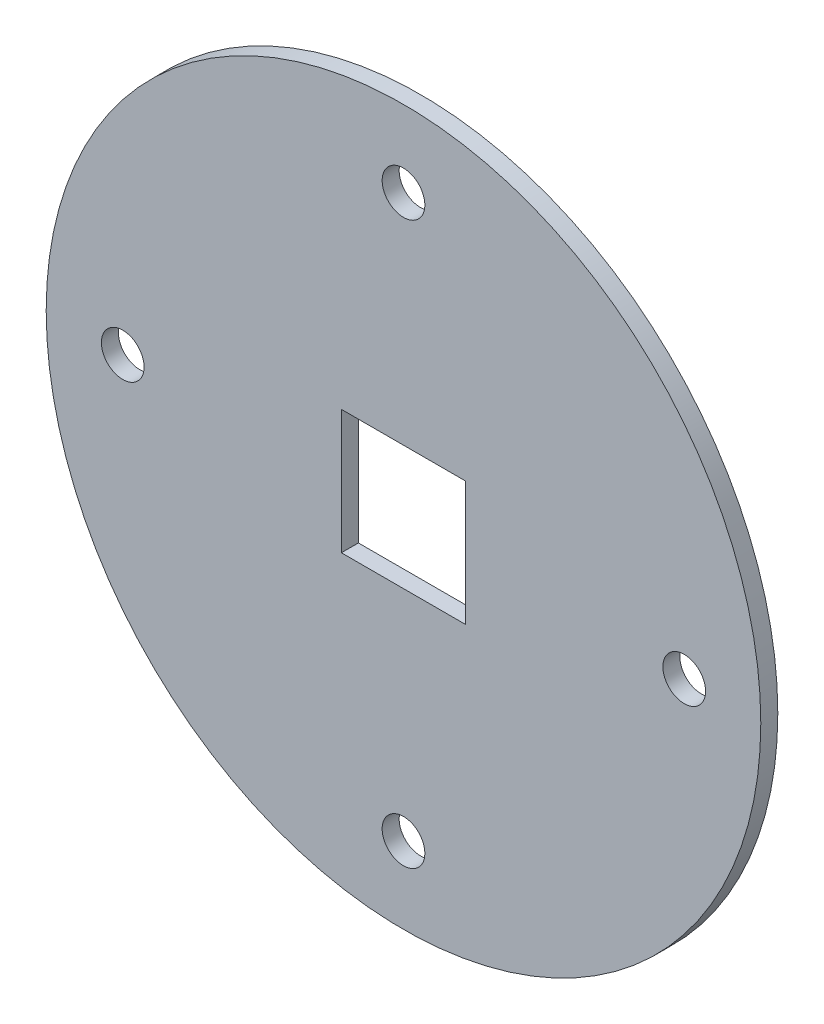
ISO-10303-21;
HEADER;
FILE_DESCRIPTION(('STEP AP214'),'2;1');
FILE_NAME('part.step','',(''),(''),'','','');
FILE_SCHEMA(('AUTOMOTIVE_DESIGN { 1 0 10303 214 1 1 1 1 }'));
ENDSEC;
DATA;
#1=APPLICATION_CONTEXT('core data for automotive mechanical design processes');
#2=APPLICATION_PROTOCOL_DEFINITION('international standard','automotive_design',2000,#1);
#3=PRODUCT_CONTEXT('',#1,'mechanical');
#4=PRODUCT('Part','Part','',(#3));
#5=PRODUCT_RELATED_PRODUCT_CATEGORY('part','',(#4));
#6=PRODUCT_DEFINITION_FORMATION('','',#4);
#7=PRODUCT_DEFINITION_CONTEXT('part definition',#1,'design');
#8=PRODUCT_DEFINITION('design','',#6,#7);
#9=PRODUCT_DEFINITION_SHAPE('','',#8);
#10=(LENGTH_UNIT() NAMED_UNIT(*) SI_UNIT(.MILLI.,.METRE.));
#11=(NAMED_UNIT(*) PLANE_ANGLE_UNIT() SI_UNIT($,.RADIAN.));
#12=(NAMED_UNIT(*) SI_UNIT($,.STERADIAN.) SOLID_ANGLE_UNIT());
#13=UNCERTAINTY_MEASURE_WITH_UNIT(LENGTH_MEASURE(1.E-05),#10,'distance_accuracy_value','');
#14=(GEOMETRIC_REPRESENTATION_CONTEXT(3) GLOBAL_UNCERTAINTY_ASSIGNED_CONTEXT((#13)) GLOBAL_UNIT_ASSIGNED_CONTEXT((#10,
#11,#12)) REPRESENTATION_CONTEXT('',''));
#15=CARTESIAN_POINT('',(0.,0.,0.));
#16=DIRECTION('',(0.,0.,1.));
#17=DIRECTION('',(1.,0.,0.));
#18=AXIS2_PLACEMENT_3D('',#15,#16,#17);
#19=CARTESIAN_POINT('',(0.,0.,10.));
#20=DIRECTION('',(0.,0.,1.));
#21=DIRECTION('',(1.,0.,0.));
#22=AXIS2_PLACEMENT_3D('',#19,#20,#21);
#23=PLANE('',#22);
#24=CARTESIAN_POINT('',(0.,-165.,10.));
#25=DIRECTION('',(0.,0.,1.));
#26=DIRECTION('',(1.,0.,0.));
#27=AXIS2_PLACEMENT_3D('',#24,#25,#26);
#28=CIRCLE('',#27,12.55);
#29=CARTESIAN_POINT('',(12.55,-165.,10.));
#30=VERTEX_POINT('',#29);
#31=EDGE_CURVE('E206',#30,#30,#28,.T.);
#32=ORIENTED_EDGE('',*,*,#31,.F.);
#33=EDGE_LOOP('',(#32));
#34=FACE_BOUND('',#33,.T.);
#35=CARTESIAN_POINT('',(0.,165.,10.));
#36=DIRECTION('',(0.,0.,1.));
#37=DIRECTION('',(1.,0.,0.));
#38=AXIS2_PLACEMENT_3D('',#35,#36,#37);
#39=CIRCLE('',#38,12.55);
#40=CARTESIAN_POINT('',(12.55,165.,10.));
#41=VERTEX_POINT('',#40);
#42=EDGE_CURVE('E102',#41,#41,#39,.T.);
#43=ORIENTED_EDGE('',*,*,#42,.F.);
#44=EDGE_LOOP('',(#43));
#45=FACE_BOUND('',#44,.T.);
#46=CARTESIAN_POINT('',(0.,0.,10.));
#47=DIRECTION('',(0.,0.,1.));
#48=DIRECTION('',(1.,0.,0.));
#49=AXIS2_PLACEMENT_3D('',#46,#47,#48);
#50=CIRCLE('',#49,210.);
#51=CARTESIAN_POINT('',(210.,0.,10.));
#52=VERTEX_POINT('',#51);
#53=EDGE_CURVE('E11',#52,#52,#50,.T.);
#54=ORIENTED_EDGE('',*,*,#53,.T.);
#55=EDGE_LOOP('',(#54));
#56=FACE_BOUND('',#55,.T.);
#57=DIRECTION('',(-1.,0.,0.));
#58=VECTOR('',#57,1.);
#59=CARTESIAN_POINT('',(-36.5,36.5,10.));
#60=LINE('',#59,#58);
#61=CARTESIAN_POINT('',(36.5,36.5,10.));
#62=VERTEX_POINT('',#61);
#63=CARTESIAN_POINT('',(-36.5,36.5,10.));
#64=VERTEX_POINT('',#63);
#65=EDGE_CURVE('E82',#62,#64,#60,.T.);
#66=ORIENTED_EDGE('',*,*,#65,.F.);
#67=DIRECTION('',(0.,1.,0.));
#68=VECTOR('',#67,1.);
#69=CARTESIAN_POINT('',(36.5,36.5,10.));
#70=LINE('',#69,#68);
#71=CARTESIAN_POINT('',(36.5,-36.5,10.));
#72=VERTEX_POINT('',#71);
#73=EDGE_CURVE('E74',#72,#62,#70,.T.);
#74=ORIENTED_EDGE('',*,*,#73,.F.);
#75=DIRECTION('',(1.,0.,0.));
#76=VECTOR('',#75,1.);
#77=CARTESIAN_POINT('',(-36.5,-36.5,10.));
#78=LINE('',#77,#76);
#79=CARTESIAN_POINT('',(-36.5,-36.5,10.));
#80=VERTEX_POINT('',#79);
#81=EDGE_CURVE('E96',#80,#72,#78,.T.);
#82=ORIENTED_EDGE('',*,*,#81,.F.);
#83=DIRECTION('',(0.,-1.,0.));
#84=VECTOR('',#83,1.);
#85=CARTESIAN_POINT('',(-36.5,36.5,10.));
#86=LINE('',#85,#84);
#87=EDGE_CURVE('E94',#64,#80,#86,.T.);
#88=ORIENTED_EDGE('',*,*,#87,.F.);
#89=EDGE_LOOP('',(#66,#74,#82,#88));
#90=FACE_BOUND('',#89,.T.);
#91=CARTESIAN_POINT('',(165.,0.,10.));
#92=DIRECTION('',(0.,0.,1.));
#93=DIRECTION('',(1.,0.,0.));
#94=AXIS2_PLACEMENT_3D('',#91,#92,#93);
#95=CIRCLE('',#94,12.55);
#96=CARTESIAN_POINT('',(177.55,0.,10.));
#97=VERTEX_POINT('',#96);
#98=EDGE_CURVE('E212',#97,#97,#95,.T.);
#99=ORIENTED_EDGE('',*,*,#98,.F.);
#100=EDGE_LOOP('',(#99));
#101=FACE_BOUND('',#100,.T.);
#102=CARTESIAN_POINT('',(-165.,0.,10.));
#103=DIRECTION('',(0.,0.,1.));
#104=DIRECTION('',(1.,0.,0.));
#105=AXIS2_PLACEMENT_3D('',#102,#103,#104);
#106=CIRCLE('',#105,12.55);
#107=CARTESIAN_POINT('',(-152.45,0.,10.));
#108=VERTEX_POINT('',#107);
#109=EDGE_CURVE('E197',#108,#108,#106,.T.);
#110=ORIENTED_EDGE('',*,*,#109,.F.);
#111=EDGE_LOOP('',(#110));
#112=FACE_BOUND('',#111,.T.);
#113=ADVANCED_FACE('F33',(#34,#45,#56,#90,#101,#112),#23,.T.);
#114=CARTESIAN_POINT('',(0.,0.,0.));
#115=DIRECTION('',(0.,0.,1.));
#116=DIRECTION('',(1.,0.,0.));
#117=AXIS2_PLACEMENT_3D('',#114,#115,#116);
#118=PLANE('',#117);
#119=CARTESIAN_POINT('',(0.,0.,0.));
#120=DIRECTION('',(0.,0.,1.));
#121=DIRECTION('',(1.,0.,0.));
#122=AXIS2_PLACEMENT_3D('',#119,#120,#121);
#123=CIRCLE('',#122,210.);
#124=CARTESIAN_POINT('',(210.,0.,0.));
#125=VERTEX_POINT('',#124);
#126=EDGE_CURVE('E37',#125,#125,#123,.T.);
#127=ORIENTED_EDGE('',*,*,#126,.F.);
#128=EDGE_LOOP('',(#127));
#129=FACE_BOUND('',#128,.T.);
#130=DIRECTION('',(0.,1.,0.));
#131=VECTOR('',#130,1.);
#132=CARTESIAN_POINT('',(36.5,36.5,0.));
#133=LINE('',#132,#131);
#134=CARTESIAN_POINT('',(36.5,-36.5,0.));
#135=VERTEX_POINT('',#134);
#136=CARTESIAN_POINT('',(36.5,36.5,0.));
#137=VERTEX_POINT('',#136);
#138=EDGE_CURVE('E56',#135,#137,#133,.T.);
#139=ORIENTED_EDGE('',*,*,#138,.T.);
#140=DIRECTION('',(-1.,0.,0.));
#141=VECTOR('',#140,1.);
#142=CARTESIAN_POINT('',(-36.5,36.5,0.));
#143=LINE('',#142,#141);
#144=CARTESIAN_POINT('',(-36.5,36.5,0.));
#145=VERTEX_POINT('',#144);
#146=EDGE_CURVE('E89',#137,#145,#143,.T.);
#147=ORIENTED_EDGE('',*,*,#146,.T.);
#148=DIRECTION('',(0.,-1.,0.));
#149=VECTOR('',#148,1.);
#150=CARTESIAN_POINT('',(-36.5,36.5,0.));
#151=LINE('',#150,#149);
#152=CARTESIAN_POINT('',(-36.5,-36.5,0.));
#153=VERTEX_POINT('',#152);
#154=EDGE_CURVE('E104',#145,#153,#151,.T.);
#155=ORIENTED_EDGE('',*,*,#154,.T.);
#156=DIRECTION('',(1.,0.,0.));
#157=VECTOR('',#156,1.);
#158=CARTESIAN_POINT('',(-36.5,-36.5,0.));
#159=LINE('',#158,#157);
#160=EDGE_CURVE('E83',#153,#135,#159,.T.);
#161=ORIENTED_EDGE('',*,*,#160,.T.);
#162=EDGE_LOOP('',(#139,#147,#155,#161));
#163=FACE_BOUND('',#162,.T.);
#164=CARTESIAN_POINT('',(0.,165.,0.));
#165=DIRECTION('',(0.,0.,1.));
#166=DIRECTION('',(1.,0.,0.));
#167=AXIS2_PLACEMENT_3D('',#164,#165,#166);
#168=CIRCLE('',#167,12.55);
#169=CARTESIAN_POINT('',(12.55,165.,0.));
#170=VERTEX_POINT('',#169);
#171=EDGE_CURVE('E215',#170,#170,#168,.T.);
#172=ORIENTED_EDGE('',*,*,#171,.T.);
#173=EDGE_LOOP('',(#172));
#174=FACE_BOUND('',#173,.T.);
#175=CARTESIAN_POINT('',(165.,0.,0.));
#176=DIRECTION('',(0.,0.,1.));
#177=DIRECTION('',(1.,0.,0.));
#178=AXIS2_PLACEMENT_3D('',#175,#176,#177);
#179=CIRCLE('',#178,12.55);
#180=CARTESIAN_POINT('',(177.55,0.,0.));
#181=VERTEX_POINT('',#180);
#182=EDGE_CURVE('E209',#181,#181,#179,.T.);
#183=ORIENTED_EDGE('',*,*,#182,.T.);
#184=EDGE_LOOP('',(#183));
#185=FACE_BOUND('',#184,.T.);
#186=CARTESIAN_POINT('',(0.,-165.,0.));
#187=DIRECTION('',(0.,0.,1.));
#188=DIRECTION('',(1.,0.,0.));
#189=AXIS2_PLACEMENT_3D('',#186,#187,#188);
#190=CIRCLE('',#189,12.55);
#191=CARTESIAN_POINT('',(12.55,-165.,0.));
#192=VERTEX_POINT('',#191);
#193=EDGE_CURVE('E203',#192,#192,#190,.T.);
#194=ORIENTED_EDGE('',*,*,#193,.T.);
#195=EDGE_LOOP('',(#194));
#196=FACE_BOUND('',#195,.T.);
#197=CARTESIAN_POINT('',(-165.,0.,0.));
#198=DIRECTION('',(0.,0.,1.));
#199=DIRECTION('',(1.,0.,0.));
#200=AXIS2_PLACEMENT_3D('',#197,#198,#199);
#201=CIRCLE('',#200,12.55);
#202=CARTESIAN_POINT('',(-152.45,0.,0.));
#203=VERTEX_POINT('',#202);
#204=EDGE_CURVE('E200',#203,#203,#201,.T.);
#205=ORIENTED_EDGE('',*,*,#204,.T.);
#206=EDGE_LOOP('',(#205));
#207=FACE_BOUND('',#206,.T.);
#208=ADVANCED_FACE('F115',(#129,#163,#174,#185,#196,#207),#118,.F.);
#209=CARTESIAN_POINT('',(0.,0.,10.));
#210=DIRECTION('',(0.,0.,-1.));
#211=DIRECTION('',(-1.,0.,0.));
#212=AXIS2_PLACEMENT_3D('',#209,#210,#211);
#213=CYLINDRICAL_SURFACE('',#212,210.);
#214=ORIENTED_EDGE('',*,*,#53,.F.);
#215=EDGE_LOOP('',(#214));
#216=FACE_BOUND('',#215,.T.);
#217=ORIENTED_EDGE('',*,*,#126,.T.);
#218=EDGE_LOOP('',(#217));
#219=FACE_BOUND('',#218,.T.);
#220=ADVANCED_FACE('F35',(#216,#219),#213,.T.);
#221=CARTESIAN_POINT('',(36.5,36.5,10.));
#222=DIRECTION('',(-1.,0.,0.));
#223=DIRECTION('',(0.,-1.,0.));
#224=AXIS2_PLACEMENT_3D('',#221,#222,#223);
#225=PLANE('',#224);
#226=ORIENTED_EDGE('',*,*,#138,.F.);
#227=DIRECTION('',(0.,0.,-1.));
#228=VECTOR('',#227,1.);
#229=CARTESIAN_POINT('',(36.5,-36.5,10.));
#230=LINE('',#229,#228);
#231=EDGE_CURVE('E78',#72,#135,#230,.T.);
#232=ORIENTED_EDGE('',*,*,#231,.F.);
#233=ORIENTED_EDGE('',*,*,#73,.T.);
#234=DIRECTION('',(0.,0.,-1.));
#235=VECTOR('',#234,1.);
#236=CARTESIAN_POINT('',(36.5,36.5,10.));
#237=LINE('',#236,#235);
#238=EDGE_CURVE('E77',#62,#137,#237,.T.);
#239=ORIENTED_EDGE('',*,*,#238,.T.);
#240=EDGE_LOOP('',(#226,#232,#233,#239));
#241=FACE_BOUND('',#240,.T.);
#242=ADVANCED_FACE('F76',(#241),#225,.T.);
#243=CARTESIAN_POINT('',(-36.5,36.5,10.));
#244=DIRECTION('',(0.,-1.,0.));
#245=DIRECTION('',(0.,0.,-1.));
#246=AXIS2_PLACEMENT_3D('',#243,#244,#245);
#247=PLANE('',#246);
#248=ORIENTED_EDGE('',*,*,#146,.F.);
#249=ORIENTED_EDGE('',*,*,#238,.F.);
#250=ORIENTED_EDGE('',*,*,#65,.T.);
#251=DIRECTION('',(0.,0.,-1.));
#252=VECTOR('',#251,1.);
#253=CARTESIAN_POINT('',(-36.5,36.5,10.));
#254=LINE('',#253,#252);
#255=EDGE_CURVE('E90',#64,#145,#254,.T.);
#256=ORIENTED_EDGE('',*,*,#255,.T.);
#257=EDGE_LOOP('',(#248,#249,#250,#256));
#258=FACE_BOUND('',#257,.T.);
#259=ADVANCED_FACE('F86',(#258),#247,.T.);
#260=CARTESIAN_POINT('',(-36.5,36.5,10.));
#261=DIRECTION('',(1.,0.,0.));
#262=DIRECTION('',(0.,1.,0.));
#263=AXIS2_PLACEMENT_3D('',#260,#261,#262);
#264=PLANE('',#263);
#265=ORIENTED_EDGE('',*,*,#154,.F.);
#266=ORIENTED_EDGE('',*,*,#255,.F.);
#267=ORIENTED_EDGE('',*,*,#87,.T.);
#268=DIRECTION('',(0.,0.,-1.));
#269=VECTOR('',#268,1.);
#270=CARTESIAN_POINT('',(-36.5,-36.5,10.));
#271=LINE('',#270,#269);
#272=EDGE_CURVE('E48',#80,#153,#271,.T.);
#273=ORIENTED_EDGE('',*,*,#272,.T.);
#274=EDGE_LOOP('',(#265,#266,#267,#273));
#275=FACE_BOUND('',#274,.T.);
#276=ADVANCED_FACE('F113',(#275),#264,.T.);
#277=CARTESIAN_POINT('',(-36.5,-36.5,10.));
#278=DIRECTION('',(0.,1.,0.));
#279=DIRECTION('',(0.,0.,1.));
#280=AXIS2_PLACEMENT_3D('',#277,#278,#279);
#281=PLANE('',#280);
#282=ORIENTED_EDGE('',*,*,#160,.F.);
#283=ORIENTED_EDGE('',*,*,#272,.F.);
#284=ORIENTED_EDGE('',*,*,#81,.T.);
#285=ORIENTED_EDGE('',*,*,#231,.T.);
#286=EDGE_LOOP('',(#282,#283,#284,#285));
#287=FACE_BOUND('',#286,.T.);
#288=ADVANCED_FACE('F117',(#287),#281,.T.);
#289=CARTESIAN_POINT('',(0.,165.,10.));
#290=DIRECTION('',(0.,0.,-1.));
#291=DIRECTION('',(-1.,0.,0.));
#292=AXIS2_PLACEMENT_3D('',#289,#290,#291);
#293=CYLINDRICAL_SURFACE('',#292,12.55);
#294=ORIENTED_EDGE('',*,*,#42,.T.);
#295=EDGE_LOOP('',(#294));
#296=FACE_BOUND('',#295,.T.);
#297=ORIENTED_EDGE('',*,*,#171,.F.);
#298=EDGE_LOOP('',(#297));
#299=FACE_BOUND('',#298,.T.);
#300=ADVANCED_FACE('F119',(#296,#299),#293,.F.);
#301=CARTESIAN_POINT('',(165.,0.,10.));
#302=DIRECTION('',(0.,0.,-1.));
#303=DIRECTION('',(-1.,0.,0.));
#304=AXIS2_PLACEMENT_3D('',#301,#302,#303);
#305=CYLINDRICAL_SURFACE('',#304,12.55);
#306=ORIENTED_EDGE('',*,*,#98,.T.);
#307=EDGE_LOOP('',(#306));
#308=FACE_BOUND('',#307,.T.);
#309=ORIENTED_EDGE('',*,*,#182,.F.);
#310=EDGE_LOOP('',(#309));
#311=FACE_BOUND('',#310,.T.);
#312=ADVANCED_FACE('F125',(#308,#311),#305,.F.);
#313=CARTESIAN_POINT('',(0.,-165.,10.));
#314=DIRECTION('',(0.,0.,-1.));
#315=DIRECTION('',(-1.,0.,0.));
#316=AXIS2_PLACEMENT_3D('',#313,#314,#315);
#317=CYLINDRICAL_SURFACE('',#316,12.55);
#318=ORIENTED_EDGE('',*,*,#31,.T.);
#319=EDGE_LOOP('',(#318));
#320=FACE_BOUND('',#319,.T.);
#321=ORIENTED_EDGE('',*,*,#193,.F.);
#322=EDGE_LOOP('',(#321));
#323=FACE_BOUND('',#322,.T.);
#324=ADVANCED_FACE('F170',(#320,#323),#317,.F.);
#325=CARTESIAN_POINT('',(-165.,0.,10.));
#326=DIRECTION('',(0.,0.,-1.));
#327=DIRECTION('',(-1.,0.,0.));
#328=AXIS2_PLACEMENT_3D('',#325,#326,#327);
#329=CYLINDRICAL_SURFACE('',#328,12.55);
#330=ORIENTED_EDGE('',*,*,#109,.T.);
#331=EDGE_LOOP('',(#330));
#332=FACE_BOUND('',#331,.T.);
#333=ORIENTED_EDGE('',*,*,#204,.F.);
#334=EDGE_LOOP('',(#333));
#335=FACE_BOUND('',#334,.T.);
#336=ADVANCED_FACE('F180',(#332,#335),#329,.F.);
#337=CLOSED_SHELL('',(#113,#208,#220,#242,#259,#276,#288,#300,#312,#324,#336));
#338=MANIFOLD_SOLID_BREP('B2',#337);
#339=ADVANCED_BREP_SHAPE_REPRESENTATION('',(#18,#338),#14);
#340=SHAPE_DEFINITION_REPRESENTATION(#9,#339);
ENDSEC;
END-ISO-10303-21;
